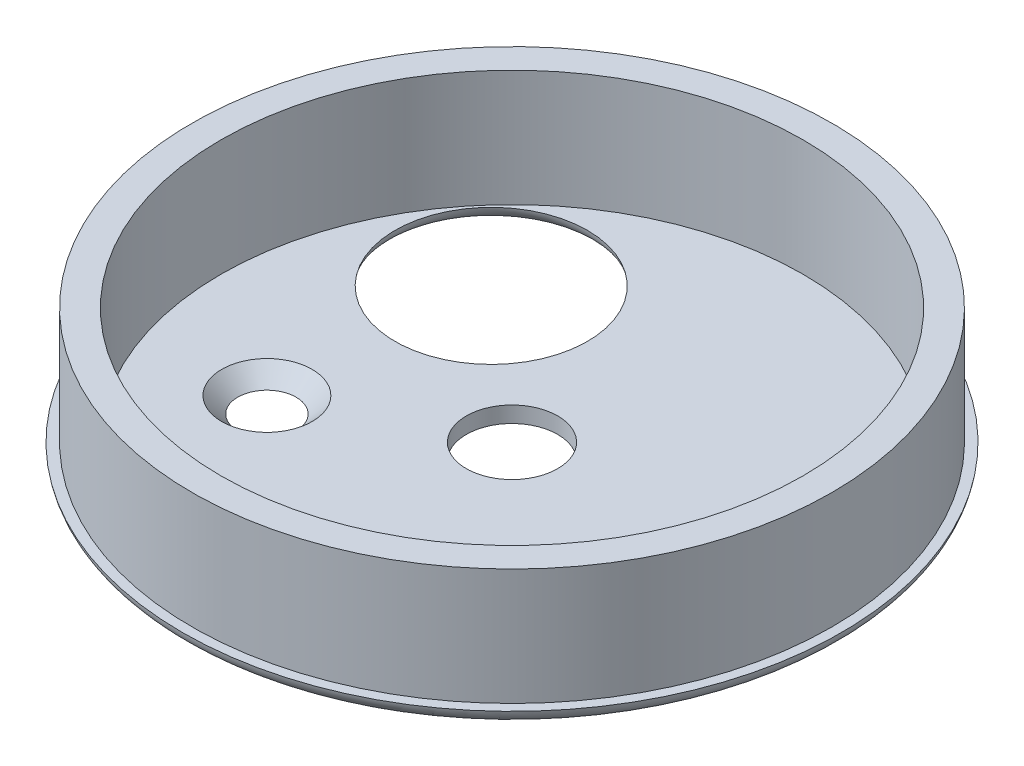
ISO-10303-21;
HEADER;
FILE_DESCRIPTION(('STEP AP214'),'2;1');
FILE_NAME('part.step','',(''),(''),'','','');
FILE_SCHEMA(('AUTOMOTIVE_DESIGN { 1 0 10303 214 1 1 1 1 }'));
ENDSEC;
DATA;
#1=APPLICATION_CONTEXT('core data for automotive mechanical design processes');
#2=APPLICATION_PROTOCOL_DEFINITION('international standard','automotive_design',2000,#1);
#3=PRODUCT_CONTEXT('',#1,'mechanical');
#4=PRODUCT('Part','Part','',(#3));
#5=PRODUCT_RELATED_PRODUCT_CATEGORY('part','',(#4));
#6=PRODUCT_DEFINITION_FORMATION('','',#4);
#7=PRODUCT_DEFINITION_CONTEXT('part definition',#1,'design');
#8=PRODUCT_DEFINITION('design','',#6,#7);
#9=PRODUCT_DEFINITION_SHAPE('','',#8);
#10=(LENGTH_UNIT() NAMED_UNIT(*) SI_UNIT(.MILLI.,.METRE.));
#11=(NAMED_UNIT(*) PLANE_ANGLE_UNIT() SI_UNIT($,.RADIAN.));
#12=(NAMED_UNIT(*) SI_UNIT($,.STERADIAN.) SOLID_ANGLE_UNIT());
#13=UNCERTAINTY_MEASURE_WITH_UNIT(LENGTH_MEASURE(1.E-05),#10,'distance_accuracy_value','');
#14=(GEOMETRIC_REPRESENTATION_CONTEXT(3) GLOBAL_UNCERTAINTY_ASSIGNED_CONTEXT((#13)) GLOBAL_UNIT_ASSIGNED_CONTEXT((#10,
#11,#12)) REPRESENTATION_CONTEXT('',''));
#15=CARTESIAN_POINT('',(0.,0.,0.));
#16=DIRECTION('',(0.,0.,1.));
#17=DIRECTION('',(1.,0.,0.));
#18=AXIS2_PLACEMENT_3D('',#15,#16,#17);
#19=CARTESIAN_POINT('',(0.,0.,0.));
#20=DIRECTION('',(0.,-1.,0.));
#21=DIRECTION('',(0.,0.,-1.));
#22=AXIS2_PLACEMENT_3D('',#19,#20,#21);
#23=PLANE('',#22);
#24=CARTESIAN_POINT('',(0.,0.,0.));
#25=DIRECTION('',(0.,1.,0.));
#26=DIRECTION('',(0.,0.,1.));
#27=AXIS2_PLACEMENT_3D('',#24,#25,#26);
#28=CIRCLE('',#27,30.25);
#29=CARTESIAN_POINT('',(0.,0.,30.25));
#30=VERTEX_POINT('',#29);
#31=EDGE_CURVE('E85',#30,#30,#28,.T.);
#32=ORIENTED_EDGE('',*,*,#31,.T.);
#33=EDGE_LOOP('',(#32));
#34=FACE_BOUND('',#33,.T.);
#35=CARTESIAN_POINT('',(0.,0.,0.));
#36=DIRECTION('',(0.,-1.,0.));
#37=DIRECTION('',(0.,0.,-1.));
#38=AXIS2_PLACEMENT_3D('',#35,#36,#37);
#39=CIRCLE('',#38,4.75);
#40=CARTESIAN_POINT('',(0.,0.,-4.75));
#41=VERTEX_POINT('',#40);
#42=EDGE_CURVE('E76',#41,#41,#39,.T.);
#43=ORIENTED_EDGE('',*,*,#42,.T.);
#44=EDGE_LOOP('',(#43));
#45=FACE_BOUND('',#44,.T.);
#46=CARTESIAN_POINT('',(-15.1566199392785,0.,-12.9964752495371));
#47=DIRECTION('',(0.,-1.,0.));
#48=DIRECTION('',(0.,0.,-1.));
#49=AXIS2_PLACEMENT_3D('',#46,#47,#48);
#50=CIRCLE('',#49,10.);
#51=CARTESIAN_POINT('',(-15.1566199392785,0.,-22.9964752495371));
#52=VERTEX_POINT('',#51);
#53=EDGE_CURVE('E71',#52,#52,#50,.T.);
#54=ORIENTED_EDGE('',*,*,#53,.T.);
#55=EDGE_LOOP('',(#54));
#56=FACE_BOUND('',#55,.T.);
#57=CARTESIAN_POINT('',(17.9655304194963,0.,6.09469783879026));
#58=DIRECTION('',(0.,1.,0.));
#59=DIRECTION('',(0.,0.,1.));
#60=AXIS2_PLACEMENT_3D('',#57,#58,#59);
#61=CIRCLE('',#60,4.7);
#62=CARTESIAN_POINT('',(17.9655304194963,0.,10.7946978387903));
#63=VERTEX_POINT('',#62);
#64=EDGE_CURVE('E58',#63,#63,#61,.T.);
#65=ORIENTED_EDGE('',*,*,#64,.F.);
#66=EDGE_LOOP('',(#65));
#67=FACE_BOUND('',#66,.T.);
#68=CARTESIAN_POINT('',(-16.9503327053474,0.,8.5200848691798));
#69=DIRECTION('',(0.,1.,0.));
#70=DIRECTION('',(0.,0.,1.));
#71=AXIS2_PLACEMENT_3D('',#68,#69,#70);
#72=CIRCLE('',#71,4.7);
#73=CARTESIAN_POINT('',(-16.9503327053474,0.,13.2200848691798));
#74=VERTEX_POINT('',#73);
#75=EDGE_CURVE('E11',#74,#74,#72,.T.);
#76=ORIENTED_EDGE('',*,*,#75,.F.);
#77=EDGE_LOOP('',(#76));
#78=FACE_BOUND('',#77,.T.);
#79=ADVANCED_FACE('F45',(#34,#45,#56,#67,#78),#23,.F.);
#80=CARTESIAN_POINT('',(0.,-1.67,0.));
#81=DIRECTION('',(0.,-1.,0.));
#82=DIRECTION('',(0.,0.,-1.));
#83=AXIS2_PLACEMENT_3D('',#80,#81,#82);
#84=PLANE('',#83);
#85=CARTESIAN_POINT('',(-16.9503327053474,-1.67,8.5200848691798));
#86=DIRECTION('',(0.,-1.,0.));
#87=DIRECTION('',(0.,0.,-1.));
#88=AXIS2_PLACEMENT_3D('',#85,#86,#87);
#89=CIRCLE('',#88,3.03);
#90=CARTESIAN_POINT('',(-16.9503327053474,-1.67,5.4900848691798));
#91=VERTEX_POINT('',#90);
#92=EDGE_CURVE('E53',#91,#91,#89,.T.);
#93=ORIENTED_EDGE('',*,*,#92,.F.);
#94=EDGE_LOOP('',(#93));
#95=FACE_BOUND('',#94,.T.);
#96=CARTESIAN_POINT('',(0.,-1.67,0.));
#97=DIRECTION('',(0.,-1.,0.));
#98=DIRECTION('',(0.,0.,-1.));
#99=AXIS2_PLACEMENT_3D('',#96,#97,#98);
#100=CIRCLE('',#99,4.75);
#101=CARTESIAN_POINT('',(0.,-1.67,-4.75));
#102=VERTEX_POINT('',#101);
#103=EDGE_CURVE('E77',#102,#102,#100,.T.);
#104=ORIENTED_EDGE('',*,*,#103,.F.);
#105=EDGE_LOOP('',(#104));
#106=FACE_BOUND('',#105,.T.);
#107=CARTESIAN_POINT('',(0.,-1.67,0.));
#108=DIRECTION('',(0.,-1.,0.));
#109=DIRECTION('',(0.,0.,-1.));
#110=AXIS2_PLACEMENT_3D('',#107,#108,#109);
#111=CIRCLE('',#110,32.2774128663098);
#112=CARTESIAN_POINT('',(0.,-1.67,-32.2774128663098));
#113=VERTEX_POINT('',#112);
#114=EDGE_CURVE('E75',#113,#113,#111,.T.);
#115=ORIENTED_EDGE('',*,*,#114,.T.);
#116=EDGE_LOOP('',(#115));
#117=FACE_BOUND('',#116,.T.);
#118=CARTESIAN_POINT('',(-15.1566199392785,-1.67,-12.9964752495371));
#119=DIRECTION('',(0.,-1.,0.));
#120=DIRECTION('',(0.,0.,-1.));
#121=AXIS2_PLACEMENT_3D('',#118,#119,#120);
#122=CIRCLE('',#121,11.9725871336902);
#123=CARTESIAN_POINT('',(-15.1566199392785,-1.67,-24.9690623832272));
#124=VERTEX_POINT('',#123);
#125=EDGE_CURVE('E100',#124,#124,#122,.F.);
#126=ORIENTED_EDGE('',*,*,#125,.T.);
#127=EDGE_LOOP('',(#126));
#128=FACE_BOUND('',#127,.T.);
#129=CARTESIAN_POINT('',(17.9655304194963,-1.67,6.09469783879026));
#130=DIRECTION('',(0.,-1.,0.));
#131=DIRECTION('',(0.,0.,-1.));
#132=AXIS2_PLACEMENT_3D('',#129,#130,#131);
#133=CIRCLE('',#132,3.03);
#134=CARTESIAN_POINT('',(17.9655304194963,-1.67,3.06469783879026));
#135=VERTEX_POINT('',#134);
#136=EDGE_CURVE('E64',#135,#135,#133,.T.);
#137=ORIENTED_EDGE('',*,*,#136,.F.);
#138=EDGE_LOOP('',(#137));
#139=FACE_BOUND('',#138,.T.);
#140=ADVANCED_FACE('F47',(#95,#106,#117,#128,#139),#84,.T.);
#141=CARTESIAN_POINT('',(0.,12.1,0.));
#142=DIRECTION('',(0.,1.,0.));
#143=DIRECTION('',(0.,0.,1.));
#144=AXIS2_PLACEMENT_3D('',#141,#142,#143);
#145=PLANE('',#144);
#146=CARTESIAN_POINT('',(0.,12.1,0.));
#147=DIRECTION('',(0.,1.,0.));
#148=DIRECTION('',(1.,0.,0.));
#149=AXIS2_PLACEMENT_3D('',#146,#147,#148);
#150=CIRCLE('',#149,33.25);
#151=CARTESIAN_POINT('',(33.25,12.1,0.));
#152=VERTEX_POINT('',#151);
#153=EDGE_CURVE('E96',#152,#152,#150,.T.);
#154=ORIENTED_EDGE('',*,*,#153,.T.);
#155=EDGE_LOOP('',(#154));
#156=FACE_BOUND('',#155,.T.);
#157=CARTESIAN_POINT('',(0.,12.1,0.));
#158=DIRECTION('',(0.,1.,0.));
#159=DIRECTION('',(0.,0.,1.));
#160=AXIS2_PLACEMENT_3D('',#157,#158,#159);
#161=CIRCLE('',#160,30.25);
#162=CARTESIAN_POINT('',(0.,12.1,30.25));
#163=VERTEX_POINT('',#162);
#164=EDGE_CURVE('E81',#163,#163,#161,.T.);
#165=ORIENTED_EDGE('',*,*,#164,.F.);
#166=EDGE_LOOP('',(#165));
#167=FACE_BOUND('',#166,.T.);
#168=ADVANCED_FACE('F147',(#156,#167),#145,.T.);
#169=CARTESIAN_POINT('',(0.,12.1,0.));
#170=DIRECTION('',(0.,-1.,0.));
#171=DIRECTION('',(0.,0.,-1.));
#172=AXIS2_PLACEMENT_3D('',#169,#170,#171);
#173=CYLINDRICAL_SURFACE('',#172,33.25);
#174=ORIENTED_EDGE('',*,*,#153,.F.);
#175=EDGE_LOOP('',(#174));
#176=FACE_BOUND('',#175,.T.);
#177=CARTESIAN_POINT('',(0.,0.,0.));
#178=DIRECTION('',(0.,1.,0.));
#179=DIRECTION('',(1.,0.,0.));
#180=AXIS2_PLACEMENT_3D('',#177,#178,#179);
#181=CIRCLE('',#180,33.25);
#182=CARTESIAN_POINT('',(33.25,0.,0.));
#183=VERTEX_POINT('',#182);
#184=EDGE_CURVE('E92',#183,#183,#181,.T.);
#185=ORIENTED_EDGE('',*,*,#184,.T.);
#186=EDGE_LOOP('',(#185));
#187=FACE_BOUND('',#186,.T.);
#188=ADVANCED_FACE('F145',(#176,#187),#173,.T.);
#189=CARTESIAN_POINT('',(0.,12.1,0.));
#190=DIRECTION('',(0.,-1.,0.));
#191=DIRECTION('',(0.,0.,-1.));
#192=AXIS2_PLACEMENT_3D('',#189,#190,#191);
#193=CYLINDRICAL_SURFACE('',#192,30.25);
#194=ORIENTED_EDGE('',*,*,#164,.T.);
#195=EDGE_LOOP('',(#194));
#196=FACE_BOUND('',#195,.T.);
#197=ORIENTED_EDGE('',*,*,#31,.F.);
#198=EDGE_LOOP('',(#197));
#199=FACE_BOUND('',#198,.T.);
#200=ADVANCED_FACE('F141',(#196,#199),#193,.F.);
#201=ORIENTED_EDGE('',*,*,#184,.F.);
#202=EDGE_LOOP('',(#201));
#203=FACE_BOUND('',#202,.T.);
#204=CARTESIAN_POINT('',(0.,0.,0.));
#205=DIRECTION('',(0.,-1.,0.));
#206=DIRECTION('',(0.,0.,-1.));
#207=AXIS2_PLACEMENT_3D('',#204,#205,#206);
#208=CIRCLE('',#207,34.25);
#209=CARTESIAN_POINT('',(0.,0.,-34.25));
#210=VERTEX_POINT('',#209);
#211=EDGE_CURVE('E70',#210,#210,#208,.T.);
#212=ORIENTED_EDGE('',*,*,#211,.F.);
#213=EDGE_LOOP('',(#212));
#214=FACE_BOUND('',#213,.T.);
#215=ADVANCED_FACE('F124',(#203,#214),#23,.F.);
#216=CARTESIAN_POINT('',(0.,0.33,0.));
#217=DIRECTION('',(0.,-1.,0.));
#218=DIRECTION('',(0.,0.,-1.));
#219=AXIS2_PLACEMENT_3D('',#216,#217,#218);
#220=CYLINDRICAL_SURFACE('',#219,4.75);
#221=ORIENTED_EDGE('',*,*,#103,.T.);
#222=EDGE_LOOP('',(#221));
#223=FACE_BOUND('',#222,.T.);
#224=ORIENTED_EDGE('',*,*,#42,.F.);
#225=EDGE_LOOP('',(#224));
#226=FACE_BOUND('',#225,.T.);
#227=ADVANCED_FACE('F136',(#223,#226),#220,.F.);
#228=CARTESIAN_POINT('',(0.,0.33,0.));
#229=DIRECTION('',(0.,1.,0.));
#230=DIRECTION('',(0.,0.,1.));
#231=AXIS2_PLACEMENT_3D('',#228,#229,#230);
#232=TOROIDAL_SURFACE('',#231,32.2774128663098,2.);
#233=ORIENTED_EDGE('',*,*,#211,.T.);
#234=EDGE_LOOP('',(#233));
#235=FACE_BOUND('',#234,.T.);
#236=ORIENTED_EDGE('',*,*,#114,.F.);
#237=EDGE_LOOP('',(#236));
#238=FACE_BOUND('',#237,.T.);
#239=ADVANCED_FACE('F116',(#235,#238),#232,.T.);
#240=CARTESIAN_POINT('',(-15.1566199392785,0.33,-12.9964752495371));
#241=DIRECTION('',(0.,-1.,0.));
#242=DIRECTION('',(0.,0.,-1.));
#243=AXIS2_PLACEMENT_3D('',#240,#241,#242);
#244=TOROIDAL_SURFACE('',#243,11.9725871336902,2.);
#245=ORIENTED_EDGE('',*,*,#125,.F.);
#246=EDGE_LOOP('',(#245));
#247=FACE_BOUND('',#246,.T.);
#248=ORIENTED_EDGE('',*,*,#53,.F.);
#249=EDGE_LOOP('',(#248));
#250=FACE_BOUND('',#249,.T.);
#251=ADVANCED_FACE('F112',(#247,#250),#244,.T.);
#252=CARTESIAN_POINT('',(17.9655304194963,0.,6.09469783879026));
#253=DIRECTION('',(0.,1.,0.));
#254=DIRECTION('',(0.,0.,1.));
#255=AXIS2_PLACEMENT_3D('',#252,#253,#254);
#256=CONICAL_SURFACE('',#255,4.7,0.785398163397448);
#257=ORIENTED_EDGE('',*,*,#136,.T.);
#258=EDGE_LOOP('',(#257));
#259=FACE_BOUND('',#258,.T.);
#260=ORIENTED_EDGE('',*,*,#64,.T.);
#261=EDGE_LOOP('',(#260));
#262=FACE_BOUND('',#261,.T.);
#263=ADVANCED_FACE('F115',(#259,#262),#256,.F.);
#264=CARTESIAN_POINT('',(-16.9503327053474,0.,8.5200848691798));
#265=DIRECTION('',(0.,1.,0.));
#266=DIRECTION('',(0.,0.,1.));
#267=AXIS2_PLACEMENT_3D('',#264,#265,#266);
#268=CONICAL_SURFACE('',#267,4.7,0.785398163397449);
#269=ORIENTED_EDGE('',*,*,#92,.T.);
#270=EDGE_LOOP('',(#269));
#271=FACE_BOUND('',#270,.T.);
#272=ORIENTED_EDGE('',*,*,#75,.T.);
#273=EDGE_LOOP('',(#272));
#274=FACE_BOUND('',#273,.T.);
#275=ADVANCED_FACE('F129',(#271,#274),#268,.F.);
#276=CLOSED_SHELL('',(#79,#140,#168,#188,#200,#215,#227,#239,#251,#263,#275));
#277=MANIFOLD_SOLID_BREP('B2',#276);
#278=ADVANCED_BREP_SHAPE_REPRESENTATION('',(#18,#277),#14);
#279=SHAPE_DEFINITION_REPRESENTATION(#9,#278);
ENDSEC;
END-ISO-10303-21;
